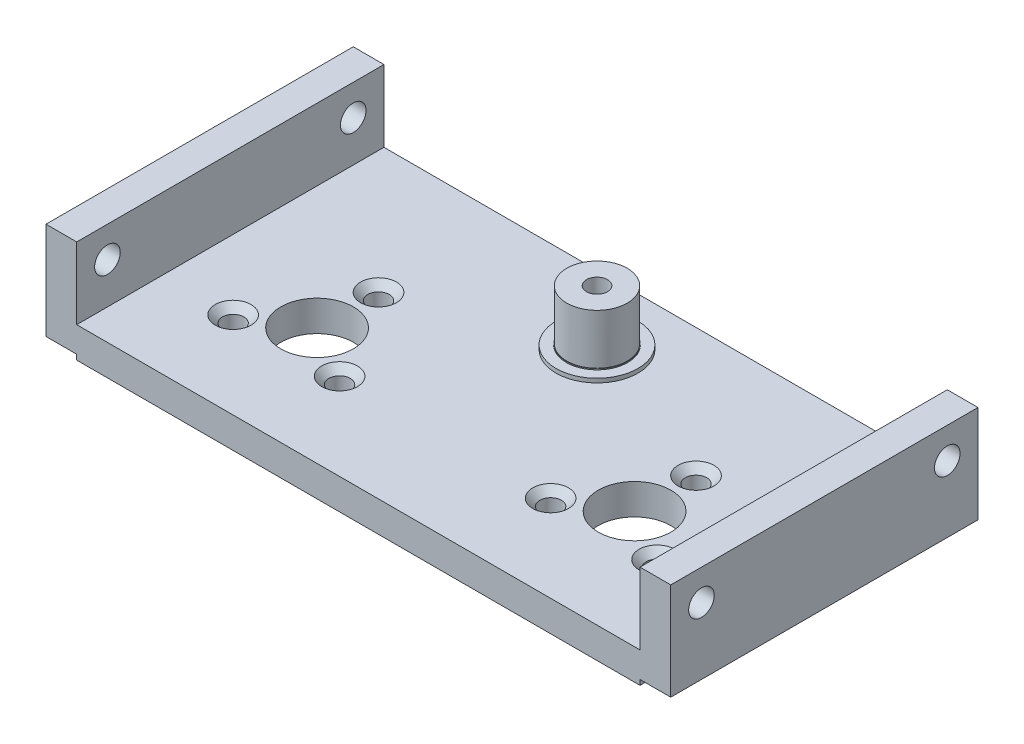
ISO-10303-21;
HEADER;
FILE_DESCRIPTION(('STEP AP214'),'2;1');
FILE_NAME('part.step','',(''),(''),'','','');
FILE_SCHEMA(('AUTOMOTIVE_DESIGN { 1 0 10303 214 1 1 1 1 }'));
ENDSEC;
DATA;
#1=APPLICATION_CONTEXT('core data for automotive mechanical design processes');
#2=APPLICATION_PROTOCOL_DEFINITION('international standard','automotive_design',2000,#1);
#3=PRODUCT_CONTEXT('',#1,'mechanical');
#4=PRODUCT('Part','Part','',(#3));
#5=PRODUCT_RELATED_PRODUCT_CATEGORY('part','',(#4));
#6=PRODUCT_DEFINITION_FORMATION('','',#4);
#7=PRODUCT_DEFINITION_CONTEXT('part definition',#1,'design');
#8=PRODUCT_DEFINITION('design','',#6,#7);
#9=PRODUCT_DEFINITION_SHAPE('','',#8);
#10=(LENGTH_UNIT() NAMED_UNIT(*) SI_UNIT(.MILLI.,.METRE.));
#11=(NAMED_UNIT(*) PLANE_ANGLE_UNIT() SI_UNIT($,.RADIAN.));
#12=(NAMED_UNIT(*) SI_UNIT($,.STERADIAN.) SOLID_ANGLE_UNIT());
#13=UNCERTAINTY_MEASURE_WITH_UNIT(LENGTH_MEASURE(1.E-05),#10,'distance_accuracy_value','');
#14=(GEOMETRIC_REPRESENTATION_CONTEXT(3) GLOBAL_UNCERTAINTY_ASSIGNED_CONTEXT((#13)) GLOBAL_UNIT_ASSIGNED_CONTEXT((#10,
#11,#12)) REPRESENTATION_CONTEXT('',''));
#15=CARTESIAN_POINT('',(0.,0.,0.));
#16=DIRECTION('',(0.,0.,1.));
#17=DIRECTION('',(1.,0.,0.));
#18=AXIS2_PLACEMENT_3D('',#15,#16,#17);
#19=CARTESIAN_POINT('',(0.,0.,0.));
#20=DIRECTION('',(0.,-1.,0.));
#21=DIRECTION('',(0.,0.,-1.));
#22=AXIS2_PLACEMENT_3D('',#19,#20,#21);
#23=PLANE('',#22);
#24=DIRECTION('',(0.,0.,1.));
#25=VECTOR('',#24,1.);
#26=CARTESIAN_POINT('',(55.,0.,-0.999999999999993));
#27=LINE('',#26,#25);
#28=CARTESIAN_POINT('',(55.,0.,-31.));
#29=VERTEX_POINT('',#28);
#30=CARTESIAN_POINT('',(55.,0.,-1.));
#31=VERTEX_POINT('',#30);
#32=EDGE_CURVE('E149',#29,#31,#27,.T.);
#33=ORIENTED_EDGE('',*,*,#32,.F.);
#34=DIRECTION('',(-1.,0.,0.));
#35=VECTOR('',#34,1.);
#36=CARTESIAN_POINT('',(0.,0.,-31.));
#37=LINE('',#36,#35);
#38=CARTESIAN_POINT('',(58.,0.,-31.));
#39=VERTEX_POINT('',#38);
#40=EDGE_CURVE('E435',#39,#29,#37,.T.);
#41=ORIENTED_EDGE('',*,*,#40,.F.);
#42=DIRECTION('',(0.,0.,-1.));
#43=VECTOR('',#42,1.);
#44=CARTESIAN_POINT('',(58.,0.,-31.));
#45=LINE('',#44,#43);
#46=CARTESIAN_POINT('',(58.,0.,-1.));
#47=VERTEX_POINT('',#46);
#48=EDGE_CURVE('E413',#47,#39,#45,.T.);
#49=ORIENTED_EDGE('',*,*,#48,.F.);
#50=DIRECTION('',(1.,0.,0.));
#51=VECTOR('',#50,1.);
#52=CARTESIAN_POINT('',(55.,0.,-1.));
#53=LINE('',#52,#51);
#54=EDGE_CURVE('E50',#31,#47,#53,.T.);
#55=ORIENTED_EDGE('',*,*,#54,.F.);
#56=EDGE_LOOP('',(#33,#41,#49,#55));
#57=FACE_BOUND('',#56,.T.);
#58=ADVANCED_FACE('F33',(#57),#23,.T.);
#59=CARTESIAN_POINT('',(43.,-7.,-18.4678404338008));
#60=DIRECTION('',(0.,1.,0.));
#61=DIRECTION('',(0.,0.,1.));
#62=AXIS2_PLACEMENT_3D('',#59,#60,#61);
#63=CYLINDRICAL_SURFACE('',#62,1.05);
#64=CARTESIAN_POINT('',(43.,1.8,-18.4678404338008));
#65=DIRECTION('',(0.,1.,0.));
#66=DIRECTION('',(0.,0.,1.));
#67=AXIS2_PLACEMENT_3D('',#64,#65,#66);
#68=CIRCLE('',#67,1.05);
#69=CARTESIAN_POINT('',(43.,1.8,-17.4178404338008));
#70=VERTEX_POINT('',#69);
#71=EDGE_CURVE('E153',#70,#70,#68,.T.);
#72=ORIENTED_EDGE('',*,*,#71,.T.);
#73=EDGE_LOOP('',(#72));
#74=FACE_BOUND('',#73,.T.);
#75=CARTESIAN_POINT('',(43.,-0.5,-18.4678404338008));
#76=DIRECTION('',(0.,-1.,0.));
#77=DIRECTION('',(0.,0.,-1.));
#78=AXIS2_PLACEMENT_3D('',#75,#76,#77);
#79=CIRCLE('',#78,1.04999999999999);
#80=CARTESIAN_POINT('',(43.,-0.5,-19.5178404338008));
#81=VERTEX_POINT('',#80);
#82=EDGE_CURVE('E187',#81,#81,#79,.T.);
#83=ORIENTED_EDGE('',*,*,#82,.T.);
#84=EDGE_LOOP('',(#83));
#85=FACE_BOUND('',#84,.T.);
#86=ADVANCED_FACE('F222',(#74,#85),#63,.F.);
#87=CARTESIAN_POINT('',(37.8038475772933,-7.,-9.4678404338008));
#88=DIRECTION('',(0.,1.,0.));
#89=DIRECTION('',(0.,0.,1.));
#90=AXIS2_PLACEMENT_3D('',#87,#88,#89);
#91=CYLINDRICAL_SURFACE('',#90,1.05);
#92=CARTESIAN_POINT('',(37.8038475772933,1.8,-9.4678404338008));
#93=DIRECTION('',(0.,1.,0.));
#94=DIRECTION('',(0.,0.,1.));
#95=AXIS2_PLACEMENT_3D('',#92,#93,#94);
#96=CIRCLE('',#95,1.05);
#97=CARTESIAN_POINT('',(37.8038475772933,1.8,-8.4178404338008));
#98=VERTEX_POINT('',#97);
#99=EDGE_CURVE('E836',#98,#98,#96,.T.);
#100=ORIENTED_EDGE('',*,*,#99,.T.);
#101=EDGE_LOOP('',(#100));
#102=FACE_BOUND('',#101,.T.);
#103=CARTESIAN_POINT('',(37.8038475772933,-0.5,-9.4678404338008));
#104=DIRECTION('',(0.,-1.,0.));
#105=DIRECTION('',(0.,0.,-1.));
#106=AXIS2_PLACEMENT_3D('',#103,#104,#105);
#107=CIRCLE('',#106,1.05);
#108=CARTESIAN_POINT('',(37.8038475772933,-0.5,-10.5178404338008));
#109=VERTEX_POINT('',#108);
#110=EDGE_CURVE('E190',#109,#109,#107,.T.);
#111=ORIENTED_EDGE('',*,*,#110,.T.);
#112=EDGE_LOOP('',(#111));
#113=FACE_BOUND('',#112,.T.);
#114=ADVANCED_FACE('F228',(#102,#113),#91,.F.);
#115=CARTESIAN_POINT('',(0.,2.5,0.));
#116=DIRECTION('',(0.,-1.,0.));
#117=DIRECTION('',(0.,0.,-1.));
#118=AXIS2_PLACEMENT_3D('',#115,#116,#117);
#119=PLANE('',#118);
#120=CARTESIAN_POINT('',(43.,2.5,-18.4678404338008));
#121=DIRECTION('',(0.,1.,0.));
#122=DIRECTION('',(0.,0.,1.));
#123=AXIS2_PLACEMENT_3D('',#120,#121,#122);
#124=CIRCLE('',#123,1.75);
#125=CARTESIAN_POINT('',(43.,2.5,-16.7178404338008));
#126=VERTEX_POINT('',#125);
#127=EDGE_CURVE('E150',#126,#126,#124,.T.);
#128=ORIENTED_EDGE('',*,*,#127,.F.);
#129=EDGE_LOOP('',(#128));
#130=FACE_BOUND('',#129,.T.);
#131=CARTESIAN_POINT('',(48.1961524227066,2.5,-9.46784043380073));
#132=DIRECTION('',(0.,1.,0.));
#133=DIRECTION('',(0.,0.,1.));
#134=AXIS2_PLACEMENT_3D('',#131,#132,#133);
#135=CIRCLE('',#134,1.75);
#136=CARTESIAN_POINT('',(48.1961524227066,2.5,-7.71784043380073));
#137=VERTEX_POINT('',#136);
#138=EDGE_CURVE('E845',#137,#137,#135,.T.);
#139=ORIENTED_EDGE('',*,*,#138,.F.);
#140=EDGE_LOOP('',(#139));
#141=FACE_BOUND('',#140,.T.);
#142=CARTESIAN_POINT('',(37.8038475772933,2.5,-9.4678404338008));
#143=DIRECTION('',(0.,1.,0.));
#144=DIRECTION('',(0.,0.,1.));
#145=AXIS2_PLACEMENT_3D('',#142,#143,#144);
#146=CIRCLE('',#145,1.75);
#147=CARTESIAN_POINT('',(37.8038475772933,2.5,-7.7178404338008));
#148=VERTEX_POINT('',#147);
#149=EDGE_CURVE('E839',#148,#148,#146,.T.);
#150=ORIENTED_EDGE('',*,*,#149,.F.);
#151=EDGE_LOOP('',(#150));
#152=FACE_BOUND('',#151,.T.);
#153=CARTESIAN_POINT('',(17.1961524227067,2.5,-9.4678404338008));
#154=DIRECTION('',(0.,1.,0.));
#155=DIRECTION('',(0.,0.,1.));
#156=AXIS2_PLACEMENT_3D('',#153,#154,#155);
#157=CIRCLE('',#156,1.75);
#158=CARTESIAN_POINT('',(17.1961524227067,2.5,-7.7178404338008));
#159=VERTEX_POINT('',#158);
#160=EDGE_CURVE('E833',#159,#159,#157,.T.);
#161=ORIENTED_EDGE('',*,*,#160,.F.);
#162=EDGE_LOOP('',(#161));
#163=FACE_BOUND('',#162,.T.);
#164=CARTESIAN_POINT('',(12.,2.5,-18.4678404338008));
#165=DIRECTION('',(0.,1.,0.));
#166=DIRECTION('',(0.,0.,1.));
#167=AXIS2_PLACEMENT_3D('',#164,#165,#166);
#168=CIRCLE('',#167,1.75);
#169=CARTESIAN_POINT('',(12.,2.5,-16.7178404338008));
#170=VERTEX_POINT('',#169);
#171=EDGE_CURVE('E823',#170,#170,#168,.T.);
#172=ORIENTED_EDGE('',*,*,#171,.F.);
#173=EDGE_LOOP('',(#172));
#174=FACE_BOUND('',#173,.T.);
#175=CARTESIAN_POINT('',(43.,2.5,-12.4678404338008));
#176=DIRECTION('',(0.,-1.,0.));
#177=DIRECTION('',(0.,0.,-1.));
#178=AXIS2_PLACEMENT_3D('',#175,#176,#177);
#179=CIRCLE('',#178,3.55);
#180=CARTESIAN_POINT('',(43.,2.5,-16.0178404338007));
#181=VERTEX_POINT('',#180);
#182=EDGE_CURVE('E345',#181,#181,#179,.F.);
#183=ORIENTED_EDGE('',*,*,#182,.F.);
#184=EDGE_LOOP('',(#183));
#185=FACE_BOUND('',#184,.T.);
#186=CARTESIAN_POINT('',(12.,2.5,-12.4678404338008));
#187=DIRECTION('',(0.,-1.,0.));
#188=DIRECTION('',(0.,0.,-1.));
#189=AXIS2_PLACEMENT_3D('',#186,#187,#188);
#190=CIRCLE('',#189,3.55);
#191=CARTESIAN_POINT('',(12.,2.5,-16.0178404338007));
#192=VERTEX_POINT('',#191);
#193=EDGE_CURVE('E342',#192,#192,#190,.T.);
#194=ORIENTED_EDGE('',*,*,#193,.T.);
#195=EDGE_LOOP('',(#194));
#196=FACE_BOUND('',#195,.T.);
#197=DIRECTION('',(0.,0.,-1.));
#198=VECTOR('',#197,1.);
#199=CARTESIAN_POINT('',(55.,2.5,-31.));
#200=LINE('',#199,#198);
#201=CARTESIAN_POINT('',(55.,2.5,-0.999999999999993));
#202=VERTEX_POINT('',#201);
#203=CARTESIAN_POINT('',(55.,2.5,-31.));
#204=VERTEX_POINT('',#203);
#205=EDGE_CURVE('E330',#202,#204,#200,.T.);
#206=ORIENTED_EDGE('',*,*,#205,.T.);
#207=DIRECTION('',(-1.,0.,0.));
#208=VECTOR('',#207,1.);
#209=CARTESIAN_POINT('',(55.,2.5,-31.));
#210=LINE('',#209,#208);
#211=CARTESIAN_POINT('',(0.,2.5,-31.));
#212=VERTEX_POINT('',#211);
#213=EDGE_CURVE('E333',#204,#212,#210,.T.);
#214=ORIENTED_EDGE('',*,*,#213,.T.);
#215=DIRECTION('',(0.,0.,1.));
#216=VECTOR('',#215,1.);
#217=CARTESIAN_POINT('',(0.,2.5,-31.));
#218=LINE('',#217,#216);
#219=CARTESIAN_POINT('',(0.,2.5,-0.999999999999993));
#220=VERTEX_POINT('',#219);
#221=EDGE_CURVE('E336',#212,#220,#218,.T.);
#222=ORIENTED_EDGE('',*,*,#221,.T.);
#223=DIRECTION('',(1.,0.,0.));
#224=VECTOR('',#223,1.);
#225=CARTESIAN_POINT('',(55.,2.5,-0.999999999999993));
#226=LINE('',#225,#224);
#227=EDGE_CURVE('E339',#220,#202,#226,.T.);
#228=ORIENTED_EDGE('',*,*,#227,.T.);
#229=EDGE_LOOP('',(#206,#214,#222,#228));
#230=FACE_BOUND('',#229,.T.);
#231=CARTESIAN_POINT('',(27.5,2.5,-24.3));
#232=DIRECTION('',(0.,1.,0.));
#233=DIRECTION('',(0.,0.,1.));
#234=AXIS2_PLACEMENT_3D('',#231,#232,#233);
#235=CIRCLE('',#234,4.);
#236=CARTESIAN_POINT('',(27.5,2.5,-20.3));
#237=VERTEX_POINT('',#236);
#238=EDGE_CURVE('E327',#237,#237,#235,.T.);
#239=ORIENTED_EDGE('',*,*,#238,.F.);
#240=EDGE_LOOP('',(#239));
#241=FACE_BOUND('',#240,.T.);
#242=CARTESIAN_POINT('',(6.80384757729338,2.5,-9.46784043380073));
#243=DIRECTION('',(0.,1.,0.));
#244=DIRECTION('',(0.,0.,1.));
#245=AXIS2_PLACEMENT_3D('',#242,#243,#244);
#246=CIRCLE('',#245,1.75);
#247=CARTESIAN_POINT('',(6.80384757729338,2.5,-7.71784043380073));
#248=VERTEX_POINT('',#247);
#249=EDGE_CURVE('E322',#248,#248,#246,.T.);
#250=ORIENTED_EDGE('',*,*,#249,.F.);
#251=EDGE_LOOP('',(#250));
#252=FACE_BOUND('',#251,.T.);
#253=ADVANCED_FACE('F302',(#130,#141,#152,#163,#174,#185,#196,#230,#241,#252),#119,.F.);
#254=CARTESIAN_POINT('',(0.,3.,0.));
#255=DIRECTION('',(0.,-1.,0.));
#256=DIRECTION('',(0.,0.,-1.));
#257=AXIS2_PLACEMENT_3D('',#254,#255,#256);
#258=PLANE('',#257);
#259=CARTESIAN_POINT('',(27.5,3.,-24.3));
#260=DIRECTION('',(0.,-1.,0.));
#261=DIRECTION('',(0.,0.,-1.));
#262=AXIS2_PLACEMENT_3D('',#259,#260,#261);
#263=CIRCLE('',#262,2.95);
#264=CARTESIAN_POINT('',(27.5,3.,-27.25));
#265=VERTEX_POINT('',#264);
#266=EDGE_CURVE('E11',#265,#265,#263,.F.);
#267=ORIENTED_EDGE('',*,*,#266,.F.);
#268=EDGE_LOOP('',(#267));
#269=FACE_BOUND('',#268,.T.);
#270=CARTESIAN_POINT('',(27.5,3.,-24.3));
#271=DIRECTION('',(0.,1.,0.));
#272=DIRECTION('',(0.,0.,1.));
#273=AXIS2_PLACEMENT_3D('',#270,#271,#272);
#274=CIRCLE('',#273,3.);
#275=CARTESIAN_POINT('',(27.5,3.,-21.3));
#276=VERTEX_POINT('',#275);
#277=EDGE_CURVE('E313',#276,#276,#274,.T.);
#278=ORIENTED_EDGE('',*,*,#277,.T.);
#279=EDGE_LOOP('',(#278));
#280=FACE_BOUND('',#279,.T.);
#281=ADVANCED_FACE('F299',(#269,#280),#258,.F.);
#282=CARTESIAN_POINT('',(27.5,7.9,-24.3));
#283=DIRECTION('',(0.,-1.,0.));
#284=DIRECTION('',(0.,0.,-1.));
#285=AXIS2_PLACEMENT_3D('',#282,#283,#284);
#286=CYLINDRICAL_SURFACE('',#285,2.95);
#287=CARTESIAN_POINT('',(27.5,7.9,-24.3));
#288=DIRECTION('',(0.,1.,0.));
#289=DIRECTION('',(0.,0.,1.));
#290=AXIS2_PLACEMENT_3D('',#287,#288,#289);
#291=CIRCLE('',#290,2.95);
#292=CARTESIAN_POINT('',(27.5,7.9,-21.35));
#293=VERTEX_POINT('',#292);
#294=EDGE_CURVE('E425',#293,#293,#291,.T.);
#295=ORIENTED_EDGE('',*,*,#294,.F.);
#296=EDGE_LOOP('',(#295));
#297=FACE_BOUND('',#296,.T.);
#298=ORIENTED_EDGE('',*,*,#266,.T.);
#299=EDGE_LOOP('',(#298));
#300=FACE_BOUND('',#299,.T.);
#301=ADVANCED_FACE('F296',(#297,#300),#286,.T.);
#302=CARTESIAN_POINT('',(27.5,7.9,-24.3));
#303=DIRECTION('',(0.,1.,0.));
#304=DIRECTION('',(0.,0.,1.));
#305=AXIS2_PLACEMENT_3D('',#302,#303,#304);
#306=PLANE('',#305);
#307=CARTESIAN_POINT('',(27.5,7.9,-24.3));
#308=DIRECTION('',(0.,1.,0.));
#309=DIRECTION('',(0.,0.,1.));
#310=AXIS2_PLACEMENT_3D('',#307,#308,#309);
#311=CIRCLE('',#310,1.025);
#312=CARTESIAN_POINT('',(27.5,7.9,-23.275));
#313=VERTEX_POINT('',#312);
#314=EDGE_CURVE('E348',#313,#313,#311,.T.);
#315=ORIENTED_EDGE('',*,*,#314,.F.);
#316=EDGE_LOOP('',(#315));
#317=FACE_BOUND('',#316,.T.);
#318=ORIENTED_EDGE('',*,*,#294,.T.);
#319=EDGE_LOOP('',(#318));
#320=FACE_BOUND('',#319,.T.);
#321=ADVANCED_FACE('F293',(#317,#320),#306,.T.);
#322=CARTESIAN_POINT('',(27.5,1.9,-24.3));
#323=DIRECTION('',(0.,1.,0.));
#324=DIRECTION('',(0.,0.,1.));
#325=AXIS2_PLACEMENT_3D('',#322,#323,#324);
#326=CONICAL_SURFACE('',#325,1.025,1.02974425867665);
#327=CARTESIAN_POINT('',(27.5,1.28411786549675,-24.3));
#328=VERTEX_POINT('',#327);
#329=VERTEX_LOOP('',#328);
#330=FACE_BOUND('',#329,.T.);
#331=CARTESIAN_POINT('',(27.5,1.9,-24.3));
#332=DIRECTION('',(0.,1.,0.));
#333=DIRECTION('',(0.,0.,1.));
#334=AXIS2_PLACEMENT_3D('',#331,#332,#333);
#335=CIRCLE('',#334,1.025);
#336=CARTESIAN_POINT('',(27.5,1.9,-23.275));
#337=VERTEX_POINT('',#336);
#338=EDGE_CURVE('E351',#337,#337,#335,.T.);
#339=ORIENTED_EDGE('',*,*,#338,.T.);
#340=EDGE_LOOP('',(#339));
#341=FACE_BOUND('',#340,.T.);
#342=ADVANCED_FACE('F254',(#330,#341),#326,.F.);
#343=CARTESIAN_POINT('',(27.5,7.9,-24.3));
#344=DIRECTION('',(0.,1.,0.));
#345=DIRECTION('',(0.,0.,1.));
#346=AXIS2_PLACEMENT_3D('',#343,#344,#345);
#347=CYLINDRICAL_SURFACE('',#346,1.025);
#348=ORIENTED_EDGE('',*,*,#338,.F.);
#349=EDGE_LOOP('',(#348));
#350=FACE_BOUND('',#349,.T.);
#351=ORIENTED_EDGE('',*,*,#314,.T.);
#352=EDGE_LOOP('',(#351));
#353=FACE_BOUND('',#352,.T.);
#354=ADVANCED_FACE('F495',(#350,#353),#347,.F.);
#355=CARTESIAN_POINT('',(27.5,2.9,-24.3));
#356=DIRECTION('',(0.,1.,0.));
#357=DIRECTION('',(0.,0.,1.));
#358=AXIS2_PLACEMENT_3D('',#355,#356,#357);
#359=PLANE('',#358);
#360=CARTESIAN_POINT('',(27.5,2.9,-24.3));
#361=DIRECTION('',(0.,1.,0.));
#362=DIRECTION('',(0.,0.,1.));
#363=AXIS2_PLACEMENT_3D('',#360,#361,#362);
#364=CIRCLE('',#363,3.);
#365=CARTESIAN_POINT('',(27.5,2.9,-21.3));
#366=VERTEX_POINT('',#365);
#367=EDGE_CURVE('E315',#366,#366,#364,.T.);
#368=ORIENTED_EDGE('',*,*,#367,.F.);
#369=EDGE_LOOP('',(#368));
#370=FACE_BOUND('',#369,.T.);
#371=CARTESIAN_POINT('',(27.5,2.9,-24.3));
#372=DIRECTION('',(0.,1.,0.));
#373=DIRECTION('',(0.,0.,1.));
#374=AXIS2_PLACEMENT_3D('',#371,#372,#373);
#375=CIRCLE('',#374,4.);
#376=CARTESIAN_POINT('',(27.5,2.9,-20.3));
#377=VERTEX_POINT('',#376);
#378=EDGE_CURVE('E319',#377,#377,#375,.T.);
#379=ORIENTED_EDGE('',*,*,#378,.T.);
#380=EDGE_LOOP('',(#379));
#381=FACE_BOUND('',#380,.T.);
#382=ADVANCED_FACE('F491',(#370,#381),#359,.T.);
#383=CARTESIAN_POINT('',(27.5,2.9,-24.3));
#384=DIRECTION('',(0.,1.,0.));
#385=DIRECTION('',(0.,0.,1.));
#386=AXIS2_PLACEMENT_3D('',#383,#384,#385);
#387=CYLINDRICAL_SURFACE('',#386,3.);
#388=ORIENTED_EDGE('',*,*,#367,.T.);
#389=EDGE_LOOP('',(#388));
#390=FACE_BOUND('',#389,.T.);
#391=ORIENTED_EDGE('',*,*,#277,.F.);
#392=EDGE_LOOP('',(#391));
#393=FACE_BOUND('',#392,.T.);
#394=ADVANCED_FACE('F265',(#390,#393),#387,.T.);
#395=CARTESIAN_POINT('',(-3.,6.5,-3.99999999999999));
#396=DIRECTION('',(-1.,0.,0.));
#397=DIRECTION('',(0.,0.,1.));
#398=AXIS2_PLACEMENT_3D('',#395,#396,#397);
#399=CYLINDRICAL_SURFACE('',#398,1.25);
#400=CARTESIAN_POINT('',(0.,6.5,-3.99999999999999));
#401=DIRECTION('',(1.,0.,0.));
#402=DIRECTION('',(0.,0.,-1.));
#403=AXIS2_PLACEMENT_3D('',#400,#401,#402);
#404=CIRCLE('',#403,1.25);
#405=CARTESIAN_POINT('',(0.,6.5,-5.24999999999999));
#406=VERTEX_POINT('',#405);
#407=EDGE_CURVE('E373',#406,#406,#404,.T.);
#408=ORIENTED_EDGE('',*,*,#407,.T.);
#409=EDGE_LOOP('',(#408));
#410=FACE_BOUND('',#409,.T.);
#411=CARTESIAN_POINT('',(-3.,6.5,-3.99999999999999));
#412=DIRECTION('',(-1.,0.,0.));
#413=DIRECTION('',(0.,0.,1.));
#414=AXIS2_PLACEMENT_3D('',#411,#412,#413);
#415=CIRCLE('',#414,1.25);
#416=CARTESIAN_POINT('',(-3.,6.5,-2.74999999999999));
#417=VERTEX_POINT('',#416);
#418=EDGE_CURVE('E370',#417,#417,#415,.T.);
#419=ORIENTED_EDGE('',*,*,#418,.T.);
#420=EDGE_LOOP('',(#419));
#421=FACE_BOUND('',#420,.T.);
#422=ADVANCED_FACE('F261',(#410,#421),#399,.F.);
#423=CARTESIAN_POINT('',(-3.,6.5,-28.));
#424=DIRECTION('',(-1.,0.,0.));
#425=DIRECTION('',(0.,0.,1.));
#426=AXIS2_PLACEMENT_3D('',#423,#424,#425);
#427=CYLINDRICAL_SURFACE('',#426,1.25);
#428=CARTESIAN_POINT('',(0.,6.5,-28.));
#429=DIRECTION('',(1.,0.,0.));
#430=DIRECTION('',(0.,0.,-1.));
#431=AXIS2_PLACEMENT_3D('',#428,#429,#430);
#432=CIRCLE('',#431,1.25);
#433=CARTESIAN_POINT('',(0.,6.5,-29.25));
#434=VERTEX_POINT('',#433);
#435=EDGE_CURVE('E367',#434,#434,#432,.T.);
#436=ORIENTED_EDGE('',*,*,#435,.T.);
#437=EDGE_LOOP('',(#436));
#438=FACE_BOUND('',#437,.T.);
#439=CARTESIAN_POINT('',(-3.,6.5,-28.));
#440=DIRECTION('',(-1.,0.,0.));
#441=DIRECTION('',(0.,0.,1.));
#442=AXIS2_PLACEMENT_3D('',#439,#440,#441);
#443=CIRCLE('',#442,1.25);
#444=CARTESIAN_POINT('',(-3.,6.5,-26.75));
#445=VERTEX_POINT('',#444);
#446=EDGE_CURVE('E364',#445,#445,#443,.T.);
#447=ORIENTED_EDGE('',*,*,#446,.T.);
#448=EDGE_LOOP('',(#447));
#449=FACE_BOUND('',#448,.T.);
#450=ADVANCED_FACE('F257',(#438,#449),#427,.F.);
#451=CARTESIAN_POINT('',(0.,9.5,0.));
#452=DIRECTION('',(0.,-1.,0.));
#453=DIRECTION('',(0.,0.,-1.));
#454=AXIS2_PLACEMENT_3D('',#451,#452,#453);
#455=PLANE('',#454);
#456=DIRECTION('',(0.,0.,-1.));
#457=VECTOR('',#456,1.);
#458=CARTESIAN_POINT('',(0.,9.5,-31.));
#459=LINE('',#458,#457);
#460=CARTESIAN_POINT('',(0.,9.5,-0.999999999999993));
#461=VERTEX_POINT('',#460);
#462=CARTESIAN_POINT('',(0.,9.5,-31.));
#463=VERTEX_POINT('',#462);
#464=EDGE_CURVE('E376',#461,#463,#459,.T.);
#465=ORIENTED_EDGE('',*,*,#464,.T.);
#466=DIRECTION('',(-1.,0.,0.));
#467=VECTOR('',#466,1.);
#468=CARTESIAN_POINT('',(0.,9.5,-31.));
#469=LINE('',#468,#467);
#470=CARTESIAN_POINT('',(-3.,9.5,-31.));
#471=VERTEX_POINT('',#470);
#472=EDGE_CURVE('E379',#463,#471,#469,.T.);
#473=ORIENTED_EDGE('',*,*,#472,.T.);
#474=DIRECTION('',(0.,0.,1.));
#475=VECTOR('',#474,1.);
#476=CARTESIAN_POINT('',(-3.,9.5,-31.));
#477=LINE('',#476,#475);
#478=CARTESIAN_POINT('',(-3.,9.5,-0.999999999999994));
#479=VERTEX_POINT('',#478);
#480=EDGE_CURVE('E382',#471,#479,#477,.T.);
#481=ORIENTED_EDGE('',*,*,#480,.T.);
#482=DIRECTION('',(1.,0.,0.));
#483=VECTOR('',#482,1.);
#484=CARTESIAN_POINT('',(0.,9.5,-0.999999999999993));
#485=LINE('',#484,#483);
#486=EDGE_CURVE('E385',#479,#461,#485,.T.);
#487=ORIENTED_EDGE('',*,*,#486,.T.);
#488=EDGE_LOOP('',(#465,#473,#481,#487));
#489=FACE_BOUND('',#488,.T.);
#490=ADVANCED_FACE('F260',(#489),#455,.F.);
#491=CARTESIAN_POINT('',(-3.,0.,-31.));
#492=DIRECTION('',(-1.,0.,0.));
#493=DIRECTION('',(0.,0.,1.));
#494=AXIS2_PLACEMENT_3D('',#491,#492,#493);
#495=PLANE('',#494);
#496=ORIENTED_EDGE('',*,*,#446,.F.);
#497=EDGE_LOOP('',(#496));
#498=FACE_BOUND('',#497,.T.);
#499=ORIENTED_EDGE('',*,*,#418,.F.);
#500=EDGE_LOOP('',(#499));
#501=FACE_BOUND('',#500,.T.);
#502=DIRECTION('',(0.,1.,0.));
#503=VECTOR('',#502,1.);
#504=CARTESIAN_POINT('',(-3.,0.,-0.999999999999994));
#505=LINE('',#504,#503);
#506=CARTESIAN_POINT('',(-3.,0.,-0.999999999999994));
#507=VERTEX_POINT('',#506);
#508=EDGE_CURVE('E394',#507,#479,#505,.T.);
#509=ORIENTED_EDGE('',*,*,#508,.T.);
#510=ORIENTED_EDGE('',*,*,#480,.F.);
#511=DIRECTION('',(0.,1.,0.));
#512=VECTOR('',#511,1.);
#513=CARTESIAN_POINT('',(-3.,0.,-31.));
#514=LINE('',#513,#512);
#515=CARTESIAN_POINT('',(-3.,0.,-31.));
#516=VERTEX_POINT('',#515);
#517=EDGE_CURVE('E453',#516,#471,#514,.T.);
#518=ORIENTED_EDGE('',*,*,#517,.F.);
#519=DIRECTION('',(0.,0.,1.));
#520=VECTOR('',#519,1.);
#521=CARTESIAN_POINT('',(-3.,0.,-31.));
#522=LINE('',#521,#520);
#523=EDGE_CURVE('E388',#516,#507,#522,.T.);
#524=ORIENTED_EDGE('',*,*,#523,.T.);
#525=EDGE_LOOP('',(#509,#510,#518,#524));
#526=FACE_BOUND('',#525,.T.);
#527=ADVANCED_FACE('F269',(#498,#501,#526),#495,.T.);
#528=CARTESIAN_POINT('',(58.,0.,-31.));
#529=DIRECTION('',(1.,0.,0.));
#530=DIRECTION('',(0.,0.,-1.));
#531=AXIS2_PLACEMENT_3D('',#528,#529,#530);
#532=PLANE('',#531);
#533=CARTESIAN_POINT('',(58.,6.5,-28.));
#534=DIRECTION('',(1.,0.,0.));
#535=DIRECTION('',(0.,0.,-1.));
#536=AXIS2_PLACEMENT_3D('',#533,#534,#535);
#537=CIRCLE('',#536,1.25);
#538=CARTESIAN_POINT('',(58.,6.5,-29.25));
#539=VERTEX_POINT('',#538);
#540=EDGE_CURVE('E354',#539,#539,#537,.T.);
#541=ORIENTED_EDGE('',*,*,#540,.F.);
#542=EDGE_LOOP('',(#541));
#543=FACE_BOUND('',#542,.T.);
#544=CARTESIAN_POINT('',(58.,6.5,-3.99999999999999));
#545=DIRECTION('',(1.,0.,0.));
#546=DIRECTION('',(0.,0.,-1.));
#547=AXIS2_PLACEMENT_3D('',#544,#545,#546);
#548=CIRCLE('',#547,1.25);
#549=CARTESIAN_POINT('',(58.,6.5,-5.24999999999999));
#550=VERTEX_POINT('',#549);
#551=EDGE_CURVE('E358',#550,#550,#548,.T.);
#552=ORIENTED_EDGE('',*,*,#551,.F.);
#553=EDGE_LOOP('',(#552));
#554=FACE_BOUND('',#553,.T.);
#555=DIRECTION('',(0.,1.,0.));
#556=VECTOR('',#555,1.);
#557=CARTESIAN_POINT('',(58.,0.,-31.));
#558=LINE('',#557,#556);
#559=CARTESIAN_POINT('',(58.,9.5,-31.));
#560=VERTEX_POINT('',#559);
#561=EDGE_CURVE('E419',#39,#560,#558,.T.);
#562=ORIENTED_EDGE('',*,*,#561,.T.);
#563=DIRECTION('',(0.,0.,-1.));
#564=VECTOR('',#563,1.);
#565=CARTESIAN_POINT('',(58.,9.5,-31.));
#566=LINE('',#565,#564);
#567=CARTESIAN_POINT('',(58.,9.5,-1.));
#568=VERTEX_POINT('',#567);
#569=EDGE_CURVE('E407',#568,#560,#566,.T.);
#570=ORIENTED_EDGE('',*,*,#569,.F.);
#571=DIRECTION('',(0.,1.,0.));
#572=VECTOR('',#571,1.);
#573=CARTESIAN_POINT('',(58.,0.,-1.));
#574=LINE('',#573,#572);
#575=EDGE_CURVE('E456',#47,#568,#574,.T.);
#576=ORIENTED_EDGE('',*,*,#575,.F.);
#577=ORIENTED_EDGE('',*,*,#48,.T.);
#578=EDGE_LOOP('',(#562,#570,#576,#577));
#579=FACE_BOUND('',#578,.T.);
#580=ADVANCED_FACE('F273',(#543,#554,#579),#532,.T.);
#581=CARTESIAN_POINT('',(0.,9.5,0.));
#582=DIRECTION('',(0.,1.,0.));
#583=DIRECTION('',(0.,0.,1.));
#584=AXIS2_PLACEMENT_3D('',#581,#582,#583);
#585=PLANE('',#584);
#586=DIRECTION('',(0.,0.,1.));
#587=VECTOR('',#586,1.);
#588=CARTESIAN_POINT('',(55.,9.5,-31.));
#589=LINE('',#588,#587);
#590=CARTESIAN_POINT('',(55.,9.5,-31.));
#591=VERTEX_POINT('',#590);
#592=CARTESIAN_POINT('',(55.,9.5,-1.));
#593=VERTEX_POINT('',#592);
#594=EDGE_CURVE('E400',#591,#593,#589,.T.);
#595=ORIENTED_EDGE('',*,*,#594,.T.);
#596=DIRECTION('',(1.,0.,0.));
#597=VECTOR('',#596,1.);
#598=CARTESIAN_POINT('',(55.,9.5,-1.));
#599=LINE('',#598,#597);
#600=EDGE_CURVE('E404',#593,#568,#599,.T.);
#601=ORIENTED_EDGE('',*,*,#600,.T.);
#602=ORIENTED_EDGE('',*,*,#569,.T.);
#603=DIRECTION('',(-1.,0.,0.));
#604=VECTOR('',#603,1.);
#605=CARTESIAN_POINT('',(55.,9.5,-31.));
#606=LINE('',#605,#604);
#607=EDGE_CURVE('E410',#560,#591,#606,.T.);
#608=ORIENTED_EDGE('',*,*,#607,.T.);
#609=EDGE_LOOP('',(#595,#601,#602,#608));
#610=FACE_BOUND('',#609,.T.);
#611=ADVANCED_FACE('F248',(#610),#585,.T.);
#612=CARTESIAN_POINT('',(58.,6.5,-3.99999999999999));
#613=DIRECTION('',(1.,0.,0.));
#614=DIRECTION('',(0.,0.,-1.));
#615=AXIS2_PLACEMENT_3D('',#612,#613,#614);
#616=CYLINDRICAL_SURFACE('',#615,1.25);
#617=CARTESIAN_POINT('',(55.,6.5,-3.99999999999999));
#618=DIRECTION('',(-1.,0.,0.));
#619=DIRECTION('',(0.,0.,1.));
#620=AXIS2_PLACEMENT_3D('',#617,#618,#619);
#621=CIRCLE('',#620,1.25);
#622=CARTESIAN_POINT('',(55.,6.5,-2.75));
#623=VERTEX_POINT('',#622);
#624=EDGE_CURVE('E361',#623,#623,#621,.T.);
#625=ORIENTED_EDGE('',*,*,#624,.T.);
#626=EDGE_LOOP('',(#625));
#627=FACE_BOUND('',#626,.T.);
#628=ORIENTED_EDGE('',*,*,#551,.T.);
#629=EDGE_LOOP('',(#628));
#630=FACE_BOUND('',#629,.T.);
#631=ADVANCED_FACE('F242',(#627,#630),#616,.F.);
#632=CARTESIAN_POINT('',(58.,6.5,-28.));
#633=DIRECTION('',(1.,0.,0.));
#634=DIRECTION('',(0.,0.,-1.));
#635=AXIS2_PLACEMENT_3D('',#632,#633,#634);
#636=CYLINDRICAL_SURFACE('',#635,1.25);
#637=CARTESIAN_POINT('',(55.,6.5,-28.));
#638=DIRECTION('',(-1.,0.,0.));
#639=DIRECTION('',(0.,0.,1.));
#640=AXIS2_PLACEMENT_3D('',#637,#638,#639);
#641=CIRCLE('',#640,1.25);
#642=CARTESIAN_POINT('',(55.,6.5,-26.75));
#643=VERTEX_POINT('',#642);
#644=EDGE_CURVE('E357',#643,#643,#641,.T.);
#645=ORIENTED_EDGE('',*,*,#644,.T.);
#646=EDGE_LOOP('',(#645));
#647=FACE_BOUND('',#646,.T.);
#648=ORIENTED_EDGE('',*,*,#540,.T.);
#649=EDGE_LOOP('',(#648));
#650=FACE_BOUND('',#649,.T.);
#651=ADVANCED_FACE('F234',(#647,#650),#636,.F.);
#652=DIRECTION('',(0.,0.,-1.));
#653=VECTOR('',#652,1.);
#654=CARTESIAN_POINT('',(0.,0.,-0.999999999999993));
#655=LINE('',#654,#653);
#656=CARTESIAN_POINT('',(0.,0.,-0.999999999999993));
#657=VERTEX_POINT('',#656);
#658=CARTESIAN_POINT('',(0.,0.,-31.));
#659=VERTEX_POINT('',#658);
#660=EDGE_CURVE('E58',#657,#659,#655,.T.);
#661=ORIENTED_EDGE('',*,*,#660,.F.);
#662=EDGE_CURVE('E42',#507,#657,#53,.T.);
#663=ORIENTED_EDGE('',*,*,#662,.F.);
#664=ORIENTED_EDGE('',*,*,#523,.F.);
#665=EDGE_CURVE('E429',#659,#516,#37,.T.);
#666=ORIENTED_EDGE('',*,*,#665,.F.);
#667=EDGE_LOOP('',(#661,#663,#664,#666));
#668=FACE_BOUND('',#667,.T.);
#669=ADVANCED_FACE('F224',(#668),#23,.T.);
#670=CARTESIAN_POINT('',(43.,-3.,-12.4678404338008));
#671=DIRECTION('',(0.,1.,0.));
#672=DIRECTION('',(0.,0.,1.));
#673=AXIS2_PLACEMENT_3D('',#670,#671,#672);
#674=CYLINDRICAL_SURFACE('',#673,3.55);
#675=ORIENTED_EDGE('',*,*,#182,.T.);
#676=EDGE_LOOP('',(#675));
#677=FACE_BOUND('',#676,.T.);
#678=CARTESIAN_POINT('',(43.,-0.5,-12.4678404338008));
#679=DIRECTION('',(0.,-1.,0.));
#680=DIRECTION('',(0.,0.,-1.));
#681=AXIS2_PLACEMENT_3D('',#678,#679,#680);
#682=CIRCLE('',#681,3.55);
#683=CARTESIAN_POINT('',(43.,-0.5,-16.0178404338007));
#684=VERTEX_POINT('',#683);
#685=EDGE_CURVE('E163',#684,#684,#682,.T.);
#686=ORIENTED_EDGE('',*,*,#685,.T.);
#687=EDGE_LOOP('',(#686));
#688=FACE_BOUND('',#687,.T.);
#689=ADVANCED_FACE('F233',(#677,#688),#674,.F.);
#690=CARTESIAN_POINT('',(12.,-3.,-12.4678404338008));
#691=DIRECTION('',(0.,1.,0.));
#692=DIRECTION('',(0.,0.,1.));
#693=AXIS2_PLACEMENT_3D('',#690,#691,#692);
#694=CYLINDRICAL_SURFACE('',#693,3.55);
#695=ORIENTED_EDGE('',*,*,#193,.F.);
#696=EDGE_LOOP('',(#695));
#697=FACE_BOUND('',#696,.T.);
#698=CARTESIAN_POINT('',(12.,-0.5,-12.4678404338008));
#699=DIRECTION('',(0.,-1.,0.));
#700=DIRECTION('',(0.,0.,-1.));
#701=AXIS2_PLACEMENT_3D('',#698,#699,#700);
#702=CIRCLE('',#701,3.55);
#703=CARTESIAN_POINT('',(12.,-0.5,-16.0178404338007));
#704=VERTEX_POINT('',#703);
#705=EDGE_CURVE('E193',#704,#704,#702,.T.);
#706=ORIENTED_EDGE('',*,*,#705,.T.);
#707=EDGE_LOOP('',(#706));
#708=FACE_BOUND('',#707,.T.);
#709=ADVANCED_FACE('F239',(#697,#708),#694,.F.);
#710=CARTESIAN_POINT('',(6.80384757729338,-7.,-9.46784043380073));
#711=DIRECTION('',(0.,1.,0.));
#712=DIRECTION('',(0.,0.,1.));
#713=AXIS2_PLACEMENT_3D('',#710,#711,#712);
#714=CYLINDRICAL_SURFACE('',#713,1.05);
#715=CARTESIAN_POINT('',(6.80384757729338,1.8,-9.46784043380073));
#716=DIRECTION('',(0.,1.,0.));
#717=DIRECTION('',(0.,0.,1.));
#718=AXIS2_PLACEMENT_3D('',#715,#716,#717);
#719=CIRCLE('',#718,1.05);
#720=CARTESIAN_POINT('',(6.80384757729338,1.8,-8.41784043380073));
#721=VERTEX_POINT('',#720);
#722=EDGE_CURVE('E316',#721,#721,#719,.T.);
#723=ORIENTED_EDGE('',*,*,#722,.T.);
#724=EDGE_LOOP('',(#723));
#725=FACE_BOUND('',#724,.T.);
#726=CARTESIAN_POINT('',(6.80384757729338,-0.5,-9.46784043380073));
#727=DIRECTION('',(0.,-1.,0.));
#728=DIRECTION('',(0.,0.,-1.));
#729=AXIS2_PLACEMENT_3D('',#726,#727,#728);
#730=CIRCLE('',#729,1.05);
#731=CARTESIAN_POINT('',(6.80384757729338,-0.5,-10.5178404338007));
#732=VERTEX_POINT('',#731);
#733=EDGE_CURVE('E202',#732,#732,#730,.T.);
#734=ORIENTED_EDGE('',*,*,#733,.T.);
#735=EDGE_LOOP('',(#734));
#736=FACE_BOUND('',#735,.T.);
#737=ADVANCED_FACE('F206',(#725,#736),#714,.F.);
#738=CARTESIAN_POINT('',(55.,3.,-1.));
#739=DIRECTION('',(0.,0.,-1.));
#740=DIRECTION('',(-1.,0.,0.));
#741=AXIS2_PLACEMENT_3D('',#738,#739,#740);
#742=PLANE('',#741);
#743=DIRECTION('',(0.,1.,0.));
#744=VECTOR('',#743,1.);
#745=CARTESIAN_POINT('',(55.,0.,-1.));
#746=LINE('',#745,#744);
#747=EDGE_CURVE('E416',#202,#593,#746,.T.);
#748=ORIENTED_EDGE('',*,*,#747,.F.);
#749=ORIENTED_EDGE('',*,*,#227,.F.);
#750=DIRECTION('',(0.,1.,0.));
#751=VECTOR('',#750,1.);
#752=CARTESIAN_POINT('',(0.,0.,-0.999999999999993));
#753=LINE('',#752,#751);
#754=EDGE_CURVE('E397',#220,#461,#753,.T.);
#755=ORIENTED_EDGE('',*,*,#754,.T.);
#756=ORIENTED_EDGE('',*,*,#486,.F.);
#757=ORIENTED_EDGE('',*,*,#508,.F.);
#758=ORIENTED_EDGE('',*,*,#662,.T.);
#759=DIRECTION('',(0.,1.,0.));
#760=VECTOR('',#759,1.);
#761=CARTESIAN_POINT('',(0.,-0.5,-0.999999999999993));
#762=LINE('',#761,#760);
#763=CARTESIAN_POINT('',(0.,-0.5,-0.999999999999993));
#764=VERTEX_POINT('',#763);
#765=EDGE_CURVE('E133',#764,#657,#762,.T.);
#766=ORIENTED_EDGE('',*,*,#765,.F.);
#767=DIRECTION('',(-1.,0.,0.));
#768=VECTOR('',#767,1.);
#769=CARTESIAN_POINT('',(55.,-0.5,-0.999999999999993));
#770=LINE('',#769,#768);
#771=CARTESIAN_POINT('',(55.,-0.5,-0.999999999999993));
#772=VERTEX_POINT('',#771);
#773=EDGE_CURVE('E126',#772,#764,#770,.T.);
#774=ORIENTED_EDGE('',*,*,#773,.F.);
#775=DIRECTION('',(0.,1.,0.));
#776=VECTOR('',#775,1.);
#777=CARTESIAN_POINT('',(55.,-0.5,-0.999999999999993));
#778=LINE('',#777,#776);
#779=EDGE_CURVE('E130',#772,#31,#778,.T.);
#780=ORIENTED_EDGE('',*,*,#779,.T.);
#781=ORIENTED_EDGE('',*,*,#54,.T.);
#782=ORIENTED_EDGE('',*,*,#575,.T.);
#783=ORIENTED_EDGE('',*,*,#600,.F.);
#784=EDGE_LOOP('',(#748,#749,#755,#756,#757,#758,#766,#774,#780,#781,#782,#783));
#785=FACE_BOUND('',#784,.T.);
#786=ADVANCED_FACE('F128',(#785),#742,.F.);
#787=CARTESIAN_POINT('',(0.,0.,-31.));
#788=DIRECTION('',(1.,0.,0.));
#789=DIRECTION('',(0.,0.,-1.));
#790=AXIS2_PLACEMENT_3D('',#787,#788,#789);
#791=PLANE('',#790);
#792=ORIENTED_EDGE('',*,*,#435,.F.);
#793=EDGE_LOOP('',(#792));
#794=FACE_BOUND('',#793,.T.);
#795=ORIENTED_EDGE('',*,*,#407,.F.);
#796=EDGE_LOOP('',(#795));
#797=FACE_BOUND('',#796,.T.);
#798=ORIENTED_EDGE('',*,*,#754,.F.);
#799=ORIENTED_EDGE('',*,*,#221,.F.);
#800=DIRECTION('',(0.,1.,0.));
#801=VECTOR('',#800,1.);
#802=CARTESIAN_POINT('',(0.,0.,-31.));
#803=LINE('',#802,#801);
#804=EDGE_CURVE('E391',#212,#463,#803,.T.);
#805=ORIENTED_EDGE('',*,*,#804,.T.);
#806=ORIENTED_EDGE('',*,*,#464,.F.);
#807=EDGE_LOOP('',(#798,#799,#805,#806));
#808=FACE_BOUND('',#807,.T.);
#809=ADVANCED_FACE('F275',(#794,#797,#808),#791,.T.);
#810=CARTESIAN_POINT('',(0.,3.,-31.));
#811=DIRECTION('',(0.,0.,1.));
#812=DIRECTION('',(1.,0.,0.));
#813=AXIS2_PLACEMENT_3D('',#810,#811,#812);
#814=PLANE('',#813);
#815=ORIENTED_EDGE('',*,*,#213,.F.);
#816=DIRECTION('',(0.,1.,0.));
#817=VECTOR('',#816,1.);
#818=CARTESIAN_POINT('',(55.,0.,-31.));
#819=LINE('',#818,#817);
#820=EDGE_CURVE('E422',#204,#591,#819,.T.);
#821=ORIENTED_EDGE('',*,*,#820,.T.);
#822=ORIENTED_EDGE('',*,*,#607,.F.);
#823=ORIENTED_EDGE('',*,*,#561,.F.);
#824=ORIENTED_EDGE('',*,*,#40,.T.);
#825=DIRECTION('',(0.,1.,0.));
#826=VECTOR('',#825,1.);
#827=CARTESIAN_POINT('',(55.,-0.5,-31.));
#828=LINE('',#827,#826);
#829=CARTESIAN_POINT('',(55.,-0.5,-31.));
#830=VERTEX_POINT('',#829);
#831=EDGE_CURVE('E164',#830,#29,#828,.T.);
#832=ORIENTED_EDGE('',*,*,#831,.F.);
#833=DIRECTION('',(1.,0.,0.));
#834=VECTOR('',#833,1.);
#835=CARTESIAN_POINT('',(55.,-0.5,-31.));
#836=LINE('',#835,#834);
#837=CARTESIAN_POINT('',(0.,-0.5,-31.));
#838=VERTEX_POINT('',#837);
#839=EDGE_CURVE('E143',#838,#830,#836,.T.);
#840=ORIENTED_EDGE('',*,*,#839,.F.);
#841=DIRECTION('',(0.,1.,0.));
#842=VECTOR('',#841,1.);
#843=CARTESIAN_POINT('',(0.,-0.5,-31.));
#844=LINE('',#843,#842);
#845=EDGE_CURVE('E155',#838,#659,#844,.T.);
#846=ORIENTED_EDGE('',*,*,#845,.T.);
#847=ORIENTED_EDGE('',*,*,#665,.T.);
#848=ORIENTED_EDGE('',*,*,#517,.T.);
#849=ORIENTED_EDGE('',*,*,#472,.F.);
#850=ORIENTED_EDGE('',*,*,#804,.F.);
#851=EDGE_LOOP('',(#815,#821,#822,#823,#824,#832,#840,#846,#847,#848,#849,#850));
#852=FACE_BOUND('',#851,.T.);
#853=ADVANCED_FACE('F35',(#852),#814,.F.);
#854=CARTESIAN_POINT('',(55.,0.,-31.));
#855=DIRECTION('',(-1.,0.,0.));
#856=DIRECTION('',(0.,0.,1.));
#857=AXIS2_PLACEMENT_3D('',#854,#855,#856);
#858=PLANE('',#857);
#859=ORIENTED_EDGE('',*,*,#644,.F.);
#860=EDGE_LOOP('',(#859));
#861=FACE_BOUND('',#860,.T.);
#862=ORIENTED_EDGE('',*,*,#624,.F.);
#863=EDGE_LOOP('',(#862));
#864=FACE_BOUND('',#863,.T.);
#865=ORIENTED_EDGE('',*,*,#820,.F.);
#866=ORIENTED_EDGE('',*,*,#205,.F.);
#867=ORIENTED_EDGE('',*,*,#747,.T.);
#868=ORIENTED_EDGE('',*,*,#594,.F.);
#869=EDGE_LOOP('',(#865,#866,#867,#868));
#870=FACE_BOUND('',#869,.T.);
#871=ADVANCED_FACE('F285',(#861,#864,#870),#858,.T.);
#872=CARTESIAN_POINT('',(48.1961524227066,-7.,-9.46784043380073));
#873=DIRECTION('',(0.,1.,0.));
#874=DIRECTION('',(0.,0.,1.));
#875=AXIS2_PLACEMENT_3D('',#872,#873,#874);
#876=CYLINDRICAL_SURFACE('',#875,1.05);
#877=CARTESIAN_POINT('',(48.1961524227066,1.8,-9.46784043380073));
#878=DIRECTION('',(0.,1.,0.));
#879=DIRECTION('',(0.,0.,1.));
#880=AXIS2_PLACEMENT_3D('',#877,#878,#879);
#881=CIRCLE('',#880,1.05);
#882=CARTESIAN_POINT('',(48.1961524227066,1.8,-8.41784043380073));
#883=VERTEX_POINT('',#882);
#884=EDGE_CURVE('E842',#883,#883,#881,.T.);
#885=ORIENTED_EDGE('',*,*,#884,.T.);
#886=EDGE_LOOP('',(#885));
#887=FACE_BOUND('',#886,.T.);
#888=CARTESIAN_POINT('',(48.1961524227066,-0.5,-9.46784043380073));
#889=DIRECTION('',(0.,-1.,0.));
#890=DIRECTION('',(0.,0.,-1.));
#891=AXIS2_PLACEMENT_3D('',#888,#889,#890);
#892=CIRCLE('',#891,1.05);
#893=CARTESIAN_POINT('',(48.1961524227066,-0.5,-10.5178404338007));
#894=VERTEX_POINT('',#893);
#895=EDGE_CURVE('E184',#894,#894,#892,.T.);
#896=ORIENTED_EDGE('',*,*,#895,.T.);
#897=EDGE_LOOP('',(#896));
#898=FACE_BOUND('',#897,.T.);
#899=ADVANCED_FACE('F288',(#887,#898),#876,.F.);
#900=CARTESIAN_POINT('',(17.1961524227067,-7.,-9.4678404338008));
#901=DIRECTION('',(0.,1.,0.));
#902=DIRECTION('',(0.,0.,1.));
#903=AXIS2_PLACEMENT_3D('',#900,#901,#902);
#904=CYLINDRICAL_SURFACE('',#903,1.05);
#905=CARTESIAN_POINT('',(17.1961524227067,1.8,-9.4678404338008));
#906=DIRECTION('',(0.,1.,0.));
#907=DIRECTION('',(0.,0.,1.));
#908=AXIS2_PLACEMENT_3D('',#905,#906,#907);
#909=CIRCLE('',#908,1.05);
#910=CARTESIAN_POINT('',(17.1961524227067,1.8,-8.4178404338008));
#911=VERTEX_POINT('',#910);
#912=EDGE_CURVE('E828',#911,#911,#909,.T.);
#913=ORIENTED_EDGE('',*,*,#912,.T.);
#914=EDGE_LOOP('',(#913));
#915=FACE_BOUND('',#914,.T.);
#916=CARTESIAN_POINT('',(17.1961524227067,-0.5,-9.4678404338008));
#917=DIRECTION('',(0.,-1.,0.));
#918=DIRECTION('',(0.,0.,-1.));
#919=AXIS2_PLACEMENT_3D('',#916,#917,#918);
#920=CIRCLE('',#919,1.05);
#921=CARTESIAN_POINT('',(17.1961524227067,-0.5,-10.5178404338008));
#922=VERTEX_POINT('',#921);
#923=EDGE_CURVE('E196',#922,#922,#920,.T.);
#924=ORIENTED_EDGE('',*,*,#923,.T.);
#925=EDGE_LOOP('',(#924));
#926=FACE_BOUND('',#925,.T.);
#927=ADVANCED_FACE('F505',(#915,#926),#904,.F.);
#928=CARTESIAN_POINT('',(12.,-7.,-18.4678404338008));
#929=DIRECTION('',(0.,1.,0.));
#930=DIRECTION('',(0.,0.,1.));
#931=AXIS2_PLACEMENT_3D('',#928,#929,#930);
#932=CYLINDRICAL_SURFACE('',#931,1.05);
#933=CARTESIAN_POINT('',(12.,1.8,-18.4678404338008));
#934=DIRECTION('',(0.,1.,0.));
#935=DIRECTION('',(0.,0.,1.));
#936=AXIS2_PLACEMENT_3D('',#933,#934,#935);
#937=CIRCLE('',#936,1.05);
#938=CARTESIAN_POINT('',(12.,1.8,-17.4178404338008));
#939=VERTEX_POINT('',#938);
#940=EDGE_CURVE('E820',#939,#939,#937,.T.);
#941=ORIENTED_EDGE('',*,*,#940,.T.);
#942=EDGE_LOOP('',(#941));
#943=FACE_BOUND('',#942,.T.);
#944=CARTESIAN_POINT('',(12.,-0.5,-18.4678404338008));
#945=DIRECTION('',(0.,-1.,0.));
#946=DIRECTION('',(0.,0.,-1.));
#947=AXIS2_PLACEMENT_3D('',#944,#945,#946);
#948=CIRCLE('',#947,1.05);
#949=CARTESIAN_POINT('',(12.,-0.5,-19.5178404338008));
#950=VERTEX_POINT('',#949);
#951=EDGE_CURVE('E199',#950,#950,#948,.T.);
#952=ORIENTED_EDGE('',*,*,#951,.T.);
#953=EDGE_LOOP('',(#952));
#954=FACE_BOUND('',#953,.T.);
#955=ADVANCED_FACE('F498',(#943,#954),#932,.F.);
#956=CARTESIAN_POINT('',(27.5,2.5,-24.3));
#957=DIRECTION('',(0.,1.,0.));
#958=DIRECTION('',(0.,0.,1.));
#959=AXIS2_PLACEMENT_3D('',#956,#957,#958);
#960=CYLINDRICAL_SURFACE('',#959,4.);
#961=ORIENTED_EDGE('',*,*,#238,.T.);
#962=EDGE_LOOP('',(#961));
#963=FACE_BOUND('',#962,.T.);
#964=ORIENTED_EDGE('',*,*,#378,.F.);
#965=EDGE_LOOP('',(#964));
#966=FACE_BOUND('',#965,.T.);
#967=ADVANCED_FACE('F487',(#963,#966),#960,.T.);
#968=CARTESIAN_POINT('',(6.80384757729338,2.5,-9.46784043380073));
#969=DIRECTION('',(0.,1.,0.));
#970=DIRECTION('',(0.,0.,1.));
#971=AXIS2_PLACEMENT_3D('',#968,#969,#970);
#972=CONICAL_SURFACE('',#971,1.75,0.785398163397448);
#973=ORIENTED_EDGE('',*,*,#722,.F.);
#974=EDGE_LOOP('',(#973));
#975=FACE_BOUND('',#974,.T.);
#976=ORIENTED_EDGE('',*,*,#249,.T.);
#977=EDGE_LOOP('',(#976));
#978=FACE_BOUND('',#977,.T.);
#979=ADVANCED_FACE('F483',(#975,#978),#972,.F.);
#980=CARTESIAN_POINT('',(12.,2.5,-18.4678404338008));
#981=DIRECTION('',(0.,1.,0.));
#982=DIRECTION('',(0.,0.,1.));
#983=AXIS2_PLACEMENT_3D('',#980,#981,#982);
#984=CONICAL_SURFACE('',#983,1.75,0.785398163397448);
#985=ORIENTED_EDGE('',*,*,#940,.F.);
#986=EDGE_LOOP('',(#985));
#987=FACE_BOUND('',#986,.T.);
#988=ORIENTED_EDGE('',*,*,#171,.T.);
#989=EDGE_LOOP('',(#988));
#990=FACE_BOUND('',#989,.T.);
#991=ADVANCED_FACE('F479',(#987,#990),#984,.F.);
#992=CARTESIAN_POINT('',(17.1961524227067,2.5,-9.4678404338008));
#993=DIRECTION('',(0.,1.,0.));
#994=DIRECTION('',(0.,0.,1.));
#995=AXIS2_PLACEMENT_3D('',#992,#993,#994);
#996=CONICAL_SURFACE('',#995,1.75,0.78539816339745);
#997=ORIENTED_EDGE('',*,*,#912,.F.);
#998=EDGE_LOOP('',(#997));
#999=FACE_BOUND('',#998,.T.);
#1000=ORIENTED_EDGE('',*,*,#160,.T.);
#1001=EDGE_LOOP('',(#1000));
#1002=FACE_BOUND('',#1001,.T.);
#1003=ADVANCED_FACE('F475',(#999,#1002),#996,.F.);
#1004=CARTESIAN_POINT('',(37.8038475772933,2.5,-9.4678404338008));
#1005=DIRECTION('',(0.,1.,0.));
#1006=DIRECTION('',(0.,0.,1.));
#1007=AXIS2_PLACEMENT_3D('',#1004,#1005,#1006);
#1008=CONICAL_SURFACE('',#1007,1.75,0.785398163397452);
#1009=ORIENTED_EDGE('',*,*,#99,.F.);
#1010=EDGE_LOOP('',(#1009));
#1011=FACE_BOUND('',#1010,.T.);
#1012=ORIENTED_EDGE('',*,*,#149,.T.);
#1013=EDGE_LOOP('',(#1012));
#1014=FACE_BOUND('',#1013,.T.);
#1015=ADVANCED_FACE('F471',(#1011,#1014),#1008,.F.);
#1016=CARTESIAN_POINT('',(48.1961524227066,2.5,-9.46784043380073));
#1017=DIRECTION('',(0.,1.,0.));
#1018=DIRECTION('',(0.,0.,1.));
#1019=AXIS2_PLACEMENT_3D('',#1016,#1017,#1018);
#1020=CONICAL_SURFACE('',#1019,1.75,0.785398163397452);
#1021=ORIENTED_EDGE('',*,*,#884,.F.);
#1022=EDGE_LOOP('',(#1021));
#1023=FACE_BOUND('',#1022,.T.);
#1024=ORIENTED_EDGE('',*,*,#138,.T.);
#1025=EDGE_LOOP('',(#1024));
#1026=FACE_BOUND('',#1025,.T.);
#1027=ADVANCED_FACE('F217',(#1023,#1026),#1020,.F.);
#1028=CARTESIAN_POINT('',(43.,2.5,-18.4678404338008));
#1029=DIRECTION('',(0.,1.,0.));
#1030=DIRECTION('',(0.,0.,1.));
#1031=AXIS2_PLACEMENT_3D('',#1028,#1029,#1030);
#1032=CONICAL_SURFACE('',#1031,1.75,0.785398163397452);
#1033=ORIENTED_EDGE('',*,*,#71,.F.);
#1034=EDGE_LOOP('',(#1033));
#1035=FACE_BOUND('',#1034,.T.);
#1036=ORIENTED_EDGE('',*,*,#127,.T.);
#1037=EDGE_LOOP('',(#1036));
#1038=FACE_BOUND('',#1037,.T.);
#1039=ADVANCED_FACE('F209',(#1035,#1038),#1032,.F.);
#1040=CARTESIAN_POINT('',(0.,-0.5,0.));
#1041=DIRECTION('',(0.,1.,0.));
#1042=DIRECTION('',(0.,0.,1.));
#1043=AXIS2_PLACEMENT_3D('',#1040,#1041,#1042);
#1044=PLANE('',#1043);
#1045=DIRECTION('',(0.,0.,1.));
#1046=VECTOR('',#1045,1.);
#1047=CARTESIAN_POINT('',(55.,-0.5,-0.999999999999993));
#1048=LINE('',#1047,#1046);
#1049=EDGE_CURVE('E137',#830,#772,#1048,.T.);
#1050=ORIENTED_EDGE('',*,*,#1049,.T.);
#1051=ORIENTED_EDGE('',*,*,#773,.T.);
#1052=DIRECTION('',(0.,0.,-1.));
#1053=VECTOR('',#1052,1.);
#1054=CARTESIAN_POINT('',(0.,-0.5,-0.999999999999993));
#1055=LINE('',#1054,#1053);
#1056=EDGE_CURVE('E136',#764,#838,#1055,.T.);
#1057=ORIENTED_EDGE('',*,*,#1056,.T.);
#1058=ORIENTED_EDGE('',*,*,#839,.T.);
#1059=EDGE_LOOP('',(#1050,#1051,#1057,#1058));
#1060=FACE_BOUND('',#1059,.T.);
#1061=ORIENTED_EDGE('',*,*,#685,.F.);
#1062=EDGE_LOOP('',(#1061));
#1063=FACE_BOUND('',#1062,.T.);
#1064=ORIENTED_EDGE('',*,*,#895,.F.);
#1065=EDGE_LOOP('',(#1064));
#1066=FACE_BOUND('',#1065,.T.);
#1067=ORIENTED_EDGE('',*,*,#82,.F.);
#1068=EDGE_LOOP('',(#1067));
#1069=FACE_BOUND('',#1068,.T.);
#1070=ORIENTED_EDGE('',*,*,#110,.F.);
#1071=EDGE_LOOP('',(#1070));
#1072=FACE_BOUND('',#1071,.T.);
#1073=ORIENTED_EDGE('',*,*,#705,.F.);
#1074=EDGE_LOOP('',(#1073));
#1075=FACE_BOUND('',#1074,.T.);
#1076=ORIENTED_EDGE('',*,*,#923,.F.);
#1077=EDGE_LOOP('',(#1076));
#1078=FACE_BOUND('',#1077,.T.);
#1079=ORIENTED_EDGE('',*,*,#951,.F.);
#1080=EDGE_LOOP('',(#1079));
#1081=FACE_BOUND('',#1080,.T.);
#1082=ORIENTED_EDGE('',*,*,#733,.F.);
#1083=EDGE_LOOP('',(#1082));
#1084=FACE_BOUND('',#1083,.T.);
#1085=ADVANCED_FACE('F140',(#1060,#1063,#1066,#1069,#1072,#1075,#1078,#1081,#1084),#1044,.F.);
#1086=CARTESIAN_POINT('',(55.,-0.5,-0.999999999999993));
#1087=DIRECTION('',(-1.,0.,0.));
#1088=DIRECTION('',(0.,0.,1.));
#1089=AXIS2_PLACEMENT_3D('',#1086,#1087,#1088);
#1090=PLANE('',#1089);
#1091=ORIENTED_EDGE('',*,*,#32,.T.);
#1092=ORIENTED_EDGE('',*,*,#779,.F.);
#1093=ORIENTED_EDGE('',*,*,#1049,.F.);
#1094=ORIENTED_EDGE('',*,*,#831,.T.);
#1095=EDGE_LOOP('',(#1091,#1092,#1093,#1094));
#1096=FACE_BOUND('',#1095,.T.);
#1097=ADVANCED_FACE('F148',(#1096),#1090,.F.);
#1098=CARTESIAN_POINT('',(0.,-0.5,-0.999999999999993));
#1099=DIRECTION('',(1.,0.,0.));
#1100=DIRECTION('',(0.,0.,-1.));
#1101=AXIS2_PLACEMENT_3D('',#1098,#1099,#1100);
#1102=PLANE('',#1101);
#1103=ORIENTED_EDGE('',*,*,#660,.T.);
#1104=ORIENTED_EDGE('',*,*,#845,.F.);
#1105=ORIENTED_EDGE('',*,*,#1056,.F.);
#1106=ORIENTED_EDGE('',*,*,#765,.T.);
#1107=EDGE_LOOP('',(#1103,#1104,#1105,#1106));
#1108=FACE_BOUND('',#1107,.T.);
#1109=ADVANCED_FACE('F215',(#1108),#1102,.F.);
#1110=CLOSED_SHELL('',(#58,#86,#114,#253,#281,#301,#321,#342,#354,#382,#394,#422,#450,#490,#527,
#580,#611,#631,#651,#669,#689,#709,#737,#786,#809,#853,#871,#899,#927,#955,#967,#979,#991,#1003,
#1015,#1027,#1039,#1085,#1097,#1109));
#1111=MANIFOLD_SOLID_BREP('B2',#1110);
#1112=ADVANCED_BREP_SHAPE_REPRESENTATION('',(#18,#1111),#14);
#1113=SHAPE_DEFINITION_REPRESENTATION(#9,#1112);
ENDSEC;
END-ISO-10303-21;
